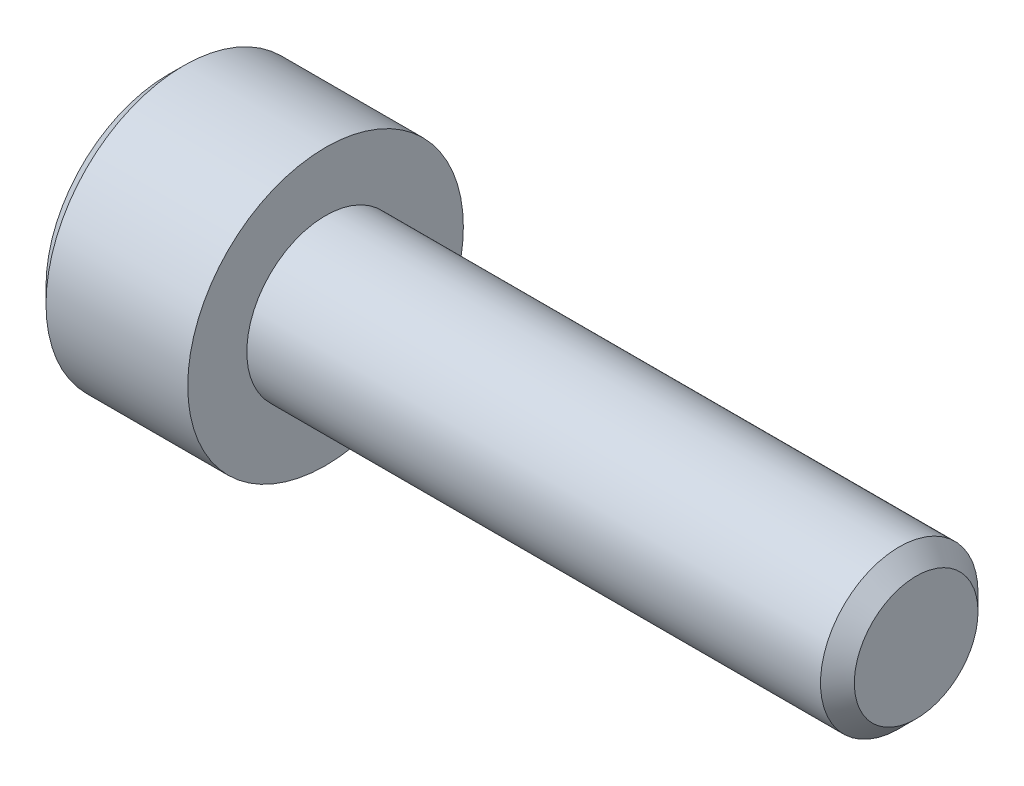
ISO-10303-21;
HEADER;
FILE_DESCRIPTION(('STEP AP214'),'2;1');
FILE_NAME('part.step','',(''),(''),'','','');
FILE_SCHEMA(('AUTOMOTIVE_DESIGN { 1 0 10303 214 1 1 1 1 }'));
ENDSEC;
DATA;
#1=APPLICATION_CONTEXT('core data for automotive mechanical design processes');
#2=APPLICATION_PROTOCOL_DEFINITION('international standard','automotive_design',2000,#1);
#3=PRODUCT_CONTEXT('',#1,'mechanical');
#4=PRODUCT('Part','Part','',(#3));
#5=PRODUCT_RELATED_PRODUCT_CATEGORY('part','',(#4));
#6=PRODUCT_DEFINITION_FORMATION('','',#4);
#7=PRODUCT_DEFINITION_CONTEXT('part definition',#1,'design');
#8=PRODUCT_DEFINITION('design','',#6,#7);
#9=PRODUCT_DEFINITION_SHAPE('','',#8);
#10=(LENGTH_UNIT() NAMED_UNIT(*) SI_UNIT(.MILLI.,.METRE.));
#11=(NAMED_UNIT(*) PLANE_ANGLE_UNIT() SI_UNIT($,.RADIAN.));
#12=(NAMED_UNIT(*) SI_UNIT($,.STERADIAN.) SOLID_ANGLE_UNIT());
#13=UNCERTAINTY_MEASURE_WITH_UNIT(LENGTH_MEASURE(1.E-05),#10,'distance_accuracy_value','');
#14=(GEOMETRIC_REPRESENTATION_CONTEXT(3) GLOBAL_UNCERTAINTY_ASSIGNED_CONTEXT((#13)) GLOBAL_UNIT_ASSIGNED_CONTEXT((#10,
#11,#12)) REPRESENTATION_CONTEXT('',''));
#15=CARTESIAN_POINT('',(0.,0.,0.));
#16=DIRECTION('',(0.,0.,1.));
#17=DIRECTION('',(1.,0.,0.));
#18=AXIS2_PLACEMENT_3D('',#15,#16,#17);
#19=CARTESIAN_POINT('',(-2.,0.,0.));
#20=DIRECTION('',(-1.,0.,0.));
#21=DIRECTION('',(0.,0.,1.));
#22=AXIS2_PLACEMENT_3D('',#19,#20,#21);
#23=CONICAL_SURFACE('',#22,1.5,1.30899693899575);
#24=CARTESIAN_POINT('',(-2.,0.,0.));
#25=DIRECTION('',(1.,0.,0.));
#26=DIRECTION('',(0.,0.,-1.));
#27=AXIS2_PLACEMENT_3D('',#24,#25,#26);
#28=CIRCLE('',#27,1.5);
#29=CARTESIAN_POINT('',(-2.,1.29903810567666,-0.75));
#30=VERTEX_POINT('',#29);
#31=CARTESIAN_POINT('',(-2.,1.29903810567666,0.75));
#32=VERTEX_POINT('',#31);
#33=EDGE_CURVE('E164',#30,#32,#28,.T.);
#34=ORIENTED_EDGE('',*,*,#33,.F.);
#35=CARTESIAN_POINT('',(-2.,0.,0.));
#36=DIRECTION('',(1.,0.,0.));
#37=DIRECTION('',(0.,0.,-1.));
#38=AXIS2_PLACEMENT_3D('',#35,#36,#37);
#39=CIRCLE('',#38,1.5);
#40=CARTESIAN_POINT('',(-2.,0.,-1.5));
#41=VERTEX_POINT('',#40);
#42=EDGE_CURVE('E160',#41,#30,#39,.T.);
#43=ORIENTED_EDGE('',*,*,#42,.F.);
#44=CARTESIAN_POINT('',(-2.,0.,0.));
#45=DIRECTION('',(1.,0.,0.));
#46=DIRECTION('',(0.,0.,-1.));
#47=AXIS2_PLACEMENT_3D('',#44,#45,#46);
#48=CIRCLE('',#47,1.5);
#49=CARTESIAN_POINT('',(-2.,-1.29903810567666,-0.75));
#50=VERTEX_POINT('',#49);
#51=EDGE_CURVE('E10',#50,#41,#48,.T.);
#52=ORIENTED_EDGE('',*,*,#51,.F.);
#53=CARTESIAN_POINT('',(-2.,0.,0.));
#54=DIRECTION('',(1.,0.,0.));
#55=DIRECTION('',(0.,0.,-1.));
#56=AXIS2_PLACEMENT_3D('',#53,#54,#55);
#57=CIRCLE('',#56,1.5);
#58=CARTESIAN_POINT('',(-2.,-1.29903810567666,0.75));
#59=VERTEX_POINT('',#58);
#60=EDGE_CURVE('E25',#59,#50,#57,.T.);
#61=ORIENTED_EDGE('',*,*,#60,.F.);
#62=CARTESIAN_POINT('',(-2.,0.,0.));
#63=DIRECTION('',(1.,0.,0.));
#64=DIRECTION('',(0.,0.,-1.));
#65=AXIS2_PLACEMENT_3D('',#62,#63,#64);
#66=CIRCLE('',#65,1.5);
#67=CARTESIAN_POINT('',(-2.,0.,1.5));
#68=VERTEX_POINT('',#67);
#69=EDGE_CURVE('E210',#68,#59,#66,.T.);
#70=ORIENTED_EDGE('',*,*,#69,.F.);
#71=CARTESIAN_POINT('',(-2.,0.,0.));
#72=DIRECTION('',(1.,0.,0.));
#73=DIRECTION('',(0.,0.,-1.));
#74=AXIS2_PLACEMENT_3D('',#71,#72,#73);
#75=CIRCLE('',#74,1.5);
#76=EDGE_CURVE('E37',#32,#68,#75,.T.);
#77=ORIENTED_EDGE('',*,*,#76,.F.);
#78=EDGE_LOOP('',(#34,#43,#52,#61,#70,#77));
#79=FACE_BOUND('',#78,.T.);
#80=CARTESIAN_POINT('',(-1.59807621135332,0.,0.));
#81=VERTEX_POINT('',#80);
#82=VERTEX_LOOP('',#81);
#83=FACE_BOUND('',#82,.T.);
#84=ADVANCED_FACE('F16',(#79,#83),#23,.F.);
#85=CARTESIAN_POINT('',(-2.,0.,0.));
#86=DIRECTION('',(1.,0.,0.));
#87=DIRECTION('',(0.,1.,0.));
#88=AXIS2_PLACEMENT_3D('',#85,#86,#87);
#89=PLANE('',#88);
#90=ORIENTED_EDGE('',*,*,#51,.T.);
#91=DIRECTION('',(0.,1.,0.));
#92=VECTOR('',#91,1.);
#93=CARTESIAN_POINT('',(-2.,-0.866025403784439,-1.5));
#94=LINE('',#93,#92);
#95=CARTESIAN_POINT('',(-2.,-0.866025403784439,-1.5));
#96=VERTEX_POINT('',#95);
#97=EDGE_CURVE('E182',#96,#41,#94,.T.);
#98=ORIENTED_EDGE('',*,*,#97,.F.);
#99=DIRECTION('',(0.,0.5,-0.866025403784439));
#100=VECTOR('',#99,1.);
#101=CARTESIAN_POINT('',(-2.,-1.73205080756888,0.));
#102=LINE('',#101,#100);
#103=EDGE_CURVE('E169',#50,#96,#102,.T.);
#104=ORIENTED_EDGE('',*,*,#103,.F.);
#105=EDGE_LOOP('',(#90,#98,#104));
#106=FACE_BOUND('',#105,.T.);
#107=ADVANCED_FACE('F226',(#106),#89,.F.);
#108=CARTESIAN_POINT('',(-2.,0.,0.));
#109=DIRECTION('',(1.,0.,0.));
#110=DIRECTION('',(0.,1.,0.));
#111=AXIS2_PLACEMENT_3D('',#108,#109,#110);
#112=PLANE('',#111);
#113=ORIENTED_EDGE('',*,*,#60,.T.);
#114=DIRECTION('',(0.,0.5,-0.866025403784439));
#115=VECTOR('',#114,1.);
#116=CARTESIAN_POINT('',(-2.,-1.73205080756888,0.));
#117=LINE('',#116,#115);
#118=CARTESIAN_POINT('',(-2.,-1.73205080756888,0.));
#119=VERTEX_POINT('',#118);
#120=EDGE_CURVE('E155',#119,#50,#117,.T.);
#121=ORIENTED_EDGE('',*,*,#120,.F.);
#122=DIRECTION('',(0.,-0.5,-0.866025403784439));
#123=VECTOR('',#122,1.);
#124=CARTESIAN_POINT('',(-2.,-0.866025403784439,1.5));
#125=LINE('',#124,#123);
#126=EDGE_CURVE('E156',#59,#119,#125,.T.);
#127=ORIENTED_EDGE('',*,*,#126,.F.);
#128=EDGE_LOOP('',(#113,#121,#127));
#129=FACE_BOUND('',#128,.T.);
#130=ADVANCED_FACE('F223',(#129),#112,.F.);
#131=CARTESIAN_POINT('',(-2.,0.,0.));
#132=DIRECTION('',(1.,0.,0.));
#133=DIRECTION('',(0.,1.,0.));
#134=AXIS2_PLACEMENT_3D('',#131,#132,#133);
#135=PLANE('',#134);
#136=ORIENTED_EDGE('',*,*,#69,.T.);
#137=DIRECTION('',(0.,-0.5,-0.866025403784439));
#138=VECTOR('',#137,1.);
#139=CARTESIAN_POINT('',(-2.,-0.866025403784439,1.5));
#140=LINE('',#139,#138);
#141=CARTESIAN_POINT('',(-2.,-0.866025403784439,1.5));
#142=VERTEX_POINT('',#141);
#143=EDGE_CURVE('E149',#142,#59,#140,.T.);
#144=ORIENTED_EDGE('',*,*,#143,.F.);
#145=DIRECTION('',(0.,-1.,0.));
#146=VECTOR('',#145,1.);
#147=CARTESIAN_POINT('',(-2.,0.866025403784439,1.5));
#148=LINE('',#147,#146);
#149=EDGE_CURVE('E150',#68,#142,#148,.T.);
#150=ORIENTED_EDGE('',*,*,#149,.F.);
#151=EDGE_LOOP('',(#136,#144,#150));
#152=FACE_BOUND('',#151,.T.);
#153=ADVANCED_FACE('F242',(#152),#135,.F.);
#154=CARTESIAN_POINT('',(-2.,0.,0.));
#155=DIRECTION('',(1.,0.,0.));
#156=DIRECTION('',(0.,1.,0.));
#157=AXIS2_PLACEMENT_3D('',#154,#155,#156);
#158=PLANE('',#157);
#159=ORIENTED_EDGE('',*,*,#76,.T.);
#160=DIRECTION('',(0.,-1.,0.));
#161=VECTOR('',#160,1.);
#162=CARTESIAN_POINT('',(-2.,0.866025403784439,1.5));
#163=LINE('',#162,#161);
#164=CARTESIAN_POINT('',(-2.,0.866025403784439,1.5));
#165=VERTEX_POINT('',#164);
#166=EDGE_CURVE('E159',#165,#68,#163,.T.);
#167=ORIENTED_EDGE('',*,*,#166,.F.);
#168=DIRECTION('',(0.,-0.5,0.866025403784439));
#169=VECTOR('',#168,1.);
#170=CARTESIAN_POINT('',(-2.,1.73205080756888,0.));
#171=LINE('',#170,#169);
#172=EDGE_CURVE('E165',#32,#165,#171,.T.);
#173=ORIENTED_EDGE('',*,*,#172,.F.);
#174=EDGE_LOOP('',(#159,#167,#173));
#175=FACE_BOUND('',#174,.T.);
#176=ADVANCED_FACE('F248',(#175),#158,.F.);
#177=CARTESIAN_POINT('',(-2.,0.,0.));
#178=DIRECTION('',(1.,0.,0.));
#179=DIRECTION('',(0.,1.,0.));
#180=AXIS2_PLACEMENT_3D('',#177,#178,#179);
#181=PLANE('',#180);
#182=DIRECTION('',(0.,0.5,0.866025403784439));
#183=VECTOR('',#182,1.);
#184=CARTESIAN_POINT('',(-2.,0.866025403784439,-1.5));
#185=LINE('',#184,#183);
#186=CARTESIAN_POINT('',(-2.,1.73205080756888,0.));
#187=VERTEX_POINT('',#186);
#188=EDGE_CURVE('E197',#30,#187,#185,.T.);
#189=ORIENTED_EDGE('',*,*,#188,.F.);
#190=ORIENTED_EDGE('',*,*,#33,.T.);
#191=DIRECTION('',(0.,-0.5,0.866025403784439));
#192=VECTOR('',#191,1.);
#193=CARTESIAN_POINT('',(-2.,1.73205080756888,0.));
#194=LINE('',#193,#192);
#195=EDGE_CURVE('E204',#187,#32,#194,.T.);
#196=ORIENTED_EDGE('',*,*,#195,.F.);
#197=EDGE_LOOP('',(#189,#190,#196));
#198=FACE_BOUND('',#197,.T.);
#199=ADVANCED_FACE('F256',(#198),#181,.F.);
#200=CARTESIAN_POINT('',(-2.,0.,0.));
#201=DIRECTION('',(1.,0.,0.));
#202=DIRECTION('',(0.,1.,0.));
#203=AXIS2_PLACEMENT_3D('',#200,#201,#202);
#204=PLANE('',#203);
#205=ORIENTED_EDGE('',*,*,#42,.T.);
#206=DIRECTION('',(0.,0.5,0.866025403784439));
#207=VECTOR('',#206,1.);
#208=CARTESIAN_POINT('',(-2.,0.866025403784439,-1.5));
#209=LINE('',#208,#207);
#210=CARTESIAN_POINT('',(-2.,0.866025403784438,-1.5));
#211=VERTEX_POINT('',#210);
#212=EDGE_CURVE('E193',#211,#30,#209,.T.);
#213=ORIENTED_EDGE('',*,*,#212,.F.);
#214=DIRECTION('',(0.,1.,0.));
#215=VECTOR('',#214,1.);
#216=CARTESIAN_POINT('',(-2.,-0.866025403784439,-1.5));
#217=LINE('',#216,#215);
#218=EDGE_CURVE('E186',#41,#211,#217,.T.);
#219=ORIENTED_EDGE('',*,*,#218,.F.);
#220=EDGE_LOOP('',(#205,#213,#219));
#221=FACE_BOUND('',#220,.T.);
#222=ADVANCED_FACE('F259',(#221),#204,.F.);
#223=CARTESIAN_POINT('',(-2.,1.73205080756888,0.));
#224=DIRECTION('',(0.,-0.866025403784439,-0.5));
#225=DIRECTION('',(0.,0.5,-0.866025403784439));
#226=AXIS2_PLACEMENT_3D('',#223,#224,#225);
#227=PLANE('',#226);
#228=DIRECTION('',(0.,-0.5,0.866025403784439));
#229=VECTOR('',#228,1.);
#230=CARTESIAN_POINT('',(-4.,1.73205080756888,0.));
#231=LINE('',#230,#229);
#232=CARTESIAN_POINT('',(-4.,1.73205080756888,0.));
#233=VERTEX_POINT('',#232);
#234=CARTESIAN_POINT('',(-4.,0.866025403784439,1.5));
#235=VERTEX_POINT('',#234);
#236=EDGE_CURVE('E285',#233,#235,#231,.T.);
#237=ORIENTED_EDGE('',*,*,#236,.F.);
#238=DIRECTION('',(-1.,0.,0.));
#239=VECTOR('',#238,1.);
#240=CARTESIAN_POINT('',(-2.,1.73205080756888,0.));
#241=LINE('',#240,#239);
#242=EDGE_CURVE('E201',#187,#233,#241,.T.);
#243=ORIENTED_EDGE('',*,*,#242,.F.);
#244=ORIENTED_EDGE('',*,*,#195,.T.);
#245=ORIENTED_EDGE('',*,*,#172,.T.);
#246=DIRECTION('',(-1.,0.,0.));
#247=VECTOR('',#246,1.);
#248=CARTESIAN_POINT('',(-2.,0.866025403784439,1.5));
#249=LINE('',#248,#247);
#250=EDGE_CURVE('E142',#165,#235,#249,.T.);
#251=ORIENTED_EDGE('',*,*,#250,.T.);
#252=EDGE_LOOP('',(#237,#243,#244,#245,#251));
#253=FACE_BOUND('',#252,.T.);
#254=ADVANCED_FACE('F253',(#253),#227,.T.);
#255=CARTESIAN_POINT('',(-2.,0.866025403784439,-1.5));
#256=DIRECTION('',(0.,-0.866025403784439,0.5));
#257=DIRECTION('',(-1.,0.,0.));
#258=AXIS2_PLACEMENT_3D('',#255,#256,#257);
#259=PLANE('',#258);
#260=DIRECTION('',(0.,0.5,0.866025403784439));
#261=VECTOR('',#260,1.);
#262=CARTESIAN_POINT('',(-4.,0.866025403784439,-1.5));
#263=LINE('',#262,#261);
#264=CARTESIAN_POINT('',(-4.,0.866025403784438,-1.5));
#265=VERTEX_POINT('',#264);
#266=EDGE_CURVE('E270',#265,#233,#263,.T.);
#267=ORIENTED_EDGE('',*,*,#266,.F.);
#268=DIRECTION('',(-1.,0.,0.));
#269=VECTOR('',#268,1.);
#270=CARTESIAN_POINT('',(-2.,0.866025403784438,-1.5));
#271=LINE('',#270,#269);
#272=EDGE_CURVE('E190',#211,#265,#271,.T.);
#273=ORIENTED_EDGE('',*,*,#272,.F.);
#274=ORIENTED_EDGE('',*,*,#212,.T.);
#275=ORIENTED_EDGE('',*,*,#188,.T.);
#276=ORIENTED_EDGE('',*,*,#242,.T.);
#277=EDGE_LOOP('',(#267,#273,#274,#275,#276));
#278=FACE_BOUND('',#277,.T.);
#279=ADVANCED_FACE('F345',(#278),#259,.T.);
#280=CARTESIAN_POINT('',(-2.,-0.866025403784439,-1.5));
#281=DIRECTION('',(0.,0.,1.));
#282=DIRECTION('',(1.,0.,0.));
#283=AXIS2_PLACEMENT_3D('',#280,#281,#282);
#284=PLANE('',#283);
#285=DIRECTION('',(0.,1.,0.));
#286=VECTOR('',#285,1.);
#287=CARTESIAN_POINT('',(-4.,-0.866025403784439,-1.5));
#288=LINE('',#287,#286);
#289=CARTESIAN_POINT('',(-4.,-0.866025403784439,-1.5));
#290=VERTEX_POINT('',#289);
#291=EDGE_CURVE('E265',#290,#265,#288,.T.);
#292=ORIENTED_EDGE('',*,*,#291,.F.);
#293=DIRECTION('',(-1.,0.,0.));
#294=VECTOR('',#293,1.);
#295=CARTESIAN_POINT('',(-2.,-0.866025403784439,-1.5));
#296=LINE('',#295,#294);
#297=EDGE_CURVE('E179',#96,#290,#296,.T.);
#298=ORIENTED_EDGE('',*,*,#297,.F.);
#299=ORIENTED_EDGE('',*,*,#97,.T.);
#300=ORIENTED_EDGE('',*,*,#218,.T.);
#301=ORIENTED_EDGE('',*,*,#272,.T.);
#302=EDGE_LOOP('',(#292,#298,#299,#300,#301));
#303=FACE_BOUND('',#302,.T.);
#304=ADVANCED_FACE('F263',(#303),#284,.T.);
#305=CARTESIAN_POINT('',(-2.,-1.73205080756888,0.));
#306=DIRECTION('',(0.,0.866025403784439,0.5));
#307=DIRECTION('',(1.,0.,0.));
#308=AXIS2_PLACEMENT_3D('',#305,#306,#307);
#309=PLANE('',#308);
#310=DIRECTION('',(0.,0.5,-0.866025403784439));
#311=VECTOR('',#310,1.);
#312=CARTESIAN_POINT('',(-4.,-1.73205080756888,0.));
#313=LINE('',#312,#311);
#314=CARTESIAN_POINT('',(-4.,-1.73205080756888,0.));
#315=VERTEX_POINT('',#314);
#316=EDGE_CURVE('E233',#315,#290,#313,.T.);
#317=ORIENTED_EDGE('',*,*,#316,.F.);
#318=DIRECTION('',(-1.,0.,0.));
#319=VECTOR('',#318,1.);
#320=CARTESIAN_POINT('',(-2.,-1.73205080756888,0.));
#321=LINE('',#320,#319);
#322=EDGE_CURVE('E152',#119,#315,#321,.T.);
#323=ORIENTED_EDGE('',*,*,#322,.F.);
#324=ORIENTED_EDGE('',*,*,#120,.T.);
#325=ORIENTED_EDGE('',*,*,#103,.T.);
#326=ORIENTED_EDGE('',*,*,#297,.T.);
#327=EDGE_LOOP('',(#317,#323,#324,#325,#326));
#328=FACE_BOUND('',#327,.T.);
#329=ADVANCED_FACE('F231',(#328),#309,.T.);
#330=CARTESIAN_POINT('',(-2.,-0.866025403784439,1.5));
#331=DIRECTION('',(0.,0.866025403784439,-0.5));
#332=DIRECTION('',(-1.,0.,0.));
#333=AXIS2_PLACEMENT_3D('',#330,#331,#332);
#334=PLANE('',#333);
#335=DIRECTION('',(0.,-0.5,-0.866025403784439));
#336=VECTOR('',#335,1.);
#337=CARTESIAN_POINT('',(-4.,-0.866025403784439,1.5));
#338=LINE('',#337,#336);
#339=CARTESIAN_POINT('',(-4.,-0.866025403784439,1.5));
#340=VERTEX_POINT('',#339);
#341=EDGE_CURVE('E275',#340,#315,#338,.T.);
#342=ORIENTED_EDGE('',*,*,#341,.F.);
#343=DIRECTION('',(-1.,0.,0.));
#344=VECTOR('',#343,1.);
#345=CARTESIAN_POINT('',(-2.,-0.866025403784439,1.5));
#346=LINE('',#345,#344);
#347=EDGE_CURVE('E148',#142,#340,#346,.T.);
#348=ORIENTED_EDGE('',*,*,#347,.F.);
#349=ORIENTED_EDGE('',*,*,#143,.T.);
#350=ORIENTED_EDGE('',*,*,#126,.T.);
#351=ORIENTED_EDGE('',*,*,#322,.T.);
#352=EDGE_LOOP('',(#342,#348,#349,#350,#351));
#353=FACE_BOUND('',#352,.T.);
#354=ADVANCED_FACE('F237',(#353),#334,.T.);
#355=CARTESIAN_POINT('',(-2.,0.866025403784439,1.5));
#356=DIRECTION('',(0.,0.,-1.));
#357=DIRECTION('',(0.,-1.,0.));
#358=AXIS2_PLACEMENT_3D('',#355,#356,#357);
#359=PLANE('',#358);
#360=DIRECTION('',(0.,-1.,0.));
#361=VECTOR('',#360,1.);
#362=CARTESIAN_POINT('',(-4.,0.866025403784439,1.5));
#363=LINE('',#362,#361);
#364=EDGE_CURVE('E294',#235,#340,#363,.T.);
#365=ORIENTED_EDGE('',*,*,#364,.F.);
#366=ORIENTED_EDGE('',*,*,#250,.F.);
#367=ORIENTED_EDGE('',*,*,#166,.T.);
#368=ORIENTED_EDGE('',*,*,#149,.T.);
#369=ORIENTED_EDGE('',*,*,#347,.T.);
#370=EDGE_LOOP('',(#365,#366,#367,#368,#369));
#371=FACE_BOUND('',#370,.T.);
#372=ADVANCED_FACE('F353',(#371),#359,.T.);
#373=CARTESIAN_POINT('',(15.,1.5705,0.));
#374=DIRECTION('',(-1.,0.,0.));
#375=DIRECTION('',(0.,0.,1.));
#376=AXIS2_PLACEMENT_3D('',#373,#374,#375);
#377=PLANE('',#376);
#378=CARTESIAN_POINT('',(15.,0.,0.));
#379=DIRECTION('',(1.,0.,0.));
#380=DIRECTION('',(0.,0.,-1.));
#381=AXIS2_PLACEMENT_3D('',#378,#379,#380);
#382=CIRCLE('',#381,1.5705);
#383=CARTESIAN_POINT('',(15.,0.,-1.5705));
#384=VERTEX_POINT('',#383);
#385=EDGE_CURVE('E135',#384,#384,#382,.T.);
#386=ORIENTED_EDGE('',*,*,#385,.T.);
#387=EDGE_LOOP('',(#386));
#388=FACE_BOUND('',#387,.T.);
#389=ADVANCED_FACE('F354',(#388),#377,.F.);
#390=CARTESIAN_POINT('',(14.5705,0.,0.));
#391=DIRECTION('',(-1.,0.,0.));
#392=DIRECTION('',(0.,0.,1.));
#393=AXIS2_PLACEMENT_3D('',#390,#391,#392);
#394=CONICAL_SURFACE('',#393,2.,0.785398163397449);
#395=CARTESIAN_POINT('',(14.5705,0.,0.));
#396=DIRECTION('',(1.,0.,0.));
#397=DIRECTION('',(0.,0.,-1.));
#398=AXIS2_PLACEMENT_3D('',#395,#396,#397);
#399=CIRCLE('',#398,2.);
#400=CARTESIAN_POINT('',(14.5705,0.,-2.));
#401=VERTEX_POINT('',#400);
#402=EDGE_CURVE('E130',#401,#401,#399,.T.);
#403=ORIENTED_EDGE('',*,*,#402,.T.);
#404=EDGE_LOOP('',(#403));
#405=FACE_BOUND('',#404,.T.);
#406=ORIENTED_EDGE('',*,*,#385,.F.);
#407=EDGE_LOOP('',(#406));
#408=FACE_BOUND('',#407,.T.);
#409=ADVANCED_FACE('F131',(#405,#408),#394,.T.);
#410=CARTESIAN_POINT('',(15.,0.,0.));
#411=DIRECTION('',(1.,0.,0.));
#412=DIRECTION('',(0.,0.,-1.));
#413=AXIS2_PLACEMENT_3D('',#410,#411,#412);
#414=CYLINDRICAL_SURFACE('',#413,2.);
#415=CARTESIAN_POINT('',(0.,0.,0.));
#416=DIRECTION('',(1.,0.,0.));
#417=DIRECTION('',(0.,0.,-1.));
#418=AXIS2_PLACEMENT_3D('',#415,#416,#417);
#419=CIRCLE('',#418,2.);
#420=CARTESIAN_POINT('',(0.,0.,-2.));
#421=VERTEX_POINT('',#420);
#422=EDGE_CURVE('E136',#421,#421,#419,.T.);
#423=ORIENTED_EDGE('',*,*,#422,.T.);
#424=EDGE_LOOP('',(#423));
#425=FACE_BOUND('',#424,.T.);
#426=ORIENTED_EDGE('',*,*,#402,.F.);
#427=EDGE_LOOP('',(#426));
#428=FACE_BOUND('',#427,.T.);
#429=ADVANCED_FACE('F362',(#425,#428),#414,.T.);
#430=CARTESIAN_POINT('',(0.,3.5,0.));
#431=DIRECTION('',(-1.,0.,0.));
#432=DIRECTION('',(0.,0.,1.));
#433=AXIS2_PLACEMENT_3D('',#430,#431,#432);
#434=PLANE('',#433);
#435=CARTESIAN_POINT('',(0.,0.,0.));
#436=DIRECTION('',(1.,0.,0.));
#437=DIRECTION('',(0.,0.,-1.));
#438=AXIS2_PLACEMENT_3D('',#435,#436,#437);
#439=CIRCLE('',#438,3.5);
#440=CARTESIAN_POINT('',(0.,0.,-3.5));
#441=VERTEX_POINT('',#440);
#442=EDGE_CURVE('E144',#441,#441,#439,.T.);
#443=ORIENTED_EDGE('',*,*,#442,.T.);
#444=EDGE_LOOP('',(#443));
#445=FACE_BOUND('',#444,.T.);
#446=ORIENTED_EDGE('',*,*,#422,.F.);
#447=EDGE_LOOP('',(#446));
#448=FACE_BOUND('',#447,.T.);
#449=ADVANCED_FACE('F328',(#445,#448),#434,.F.);
#450=CARTESIAN_POINT('',(15.,0.,0.));
#451=DIRECTION('',(1.,0.,0.));
#452=DIRECTION('',(0.,0.,-1.));
#453=AXIS2_PLACEMENT_3D('',#450,#451,#452);
#454=CYLINDRICAL_SURFACE('',#453,3.5);
#455=CARTESIAN_POINT('',(-3.6,0.,0.));
#456=DIRECTION('',(1.,0.,0.));
#457=DIRECTION('',(0.,0.,-1.));
#458=AXIS2_PLACEMENT_3D('',#455,#456,#457);
#459=CIRCLE('',#458,3.5);
#460=CARTESIAN_POINT('',(-3.6,0.,-3.5));
#461=VERTEX_POINT('',#460);
#462=EDGE_CURVE('E288',#461,#461,#459,.T.);
#463=ORIENTED_EDGE('',*,*,#462,.T.);
#464=EDGE_LOOP('',(#463));
#465=FACE_BOUND('',#464,.T.);
#466=ORIENTED_EDGE('',*,*,#442,.F.);
#467=EDGE_LOOP('',(#466));
#468=FACE_BOUND('',#467,.T.);
#469=ADVANCED_FACE('F315',(#465,#468),#454,.T.);
#470=CARTESIAN_POINT('',(-4.,0.,0.));
#471=DIRECTION('',(1.,0.,0.));
#472=DIRECTION('',(0.,0.,-1.));
#473=AXIS2_PLACEMENT_3D('',#470,#471,#472);
#474=CONICAL_SURFACE('',#473,3.1,0.785398163397447);
#475=CARTESIAN_POINT('',(-4.,0.,0.));
#476=DIRECTION('',(1.,0.,0.));
#477=DIRECTION('',(0.,0.,-1.));
#478=AXIS2_PLACEMENT_3D('',#475,#476,#477);
#479=CIRCLE('',#478,3.1);
#480=CARTESIAN_POINT('',(-4.,0.,-3.1));
#481=VERTEX_POINT('',#480);
#482=EDGE_CURVE('E277',#481,#481,#479,.T.);
#483=ORIENTED_EDGE('',*,*,#482,.T.);
#484=EDGE_LOOP('',(#483));
#485=FACE_BOUND('',#484,.T.);
#486=ORIENTED_EDGE('',*,*,#462,.F.);
#487=EDGE_LOOP('',(#486));
#488=FACE_BOUND('',#487,.T.);
#489=ADVANCED_FACE('F318',(#485,#488),#474,.T.);
#490=CARTESIAN_POINT('',(-4.,0.,0.));
#491=DIRECTION('',(1.,0.,0.));
#492=DIRECTION('',(0.,1.,0.));
#493=AXIS2_PLACEMENT_3D('',#490,#491,#492);
#494=PLANE('',#493);
#495=ORIENTED_EDGE('',*,*,#316,.T.);
#496=ORIENTED_EDGE('',*,*,#291,.T.);
#497=ORIENTED_EDGE('',*,*,#266,.T.);
#498=ORIENTED_EDGE('',*,*,#236,.T.);
#499=ORIENTED_EDGE('',*,*,#364,.T.);
#500=ORIENTED_EDGE('',*,*,#341,.T.);
#501=EDGE_LOOP('',(#495,#496,#497,#498,#499,#500));
#502=FACE_BOUND('',#501,.T.);
#503=ORIENTED_EDGE('',*,*,#482,.F.);
#504=EDGE_LOOP('',(#503));
#505=FACE_BOUND('',#504,.T.);
#506=ADVANCED_FACE('F272',(#502,#505),#494,.F.);
#507=CLOSED_SHELL('',(#84,#107,#130,#153,#176,#199,#222,#254,#279,#304,#329,#354,#372,#389,#409,
#429,#449,#469,#489,#506));
#508=MANIFOLD_SOLID_BREP('B1',#507);
#509=ADVANCED_BREP_SHAPE_REPRESENTATION('',(#18,#508),#14);
#510=SHAPE_DEFINITION_REPRESENTATION(#9,#509);
ENDSEC;
END-ISO-10303-21;
